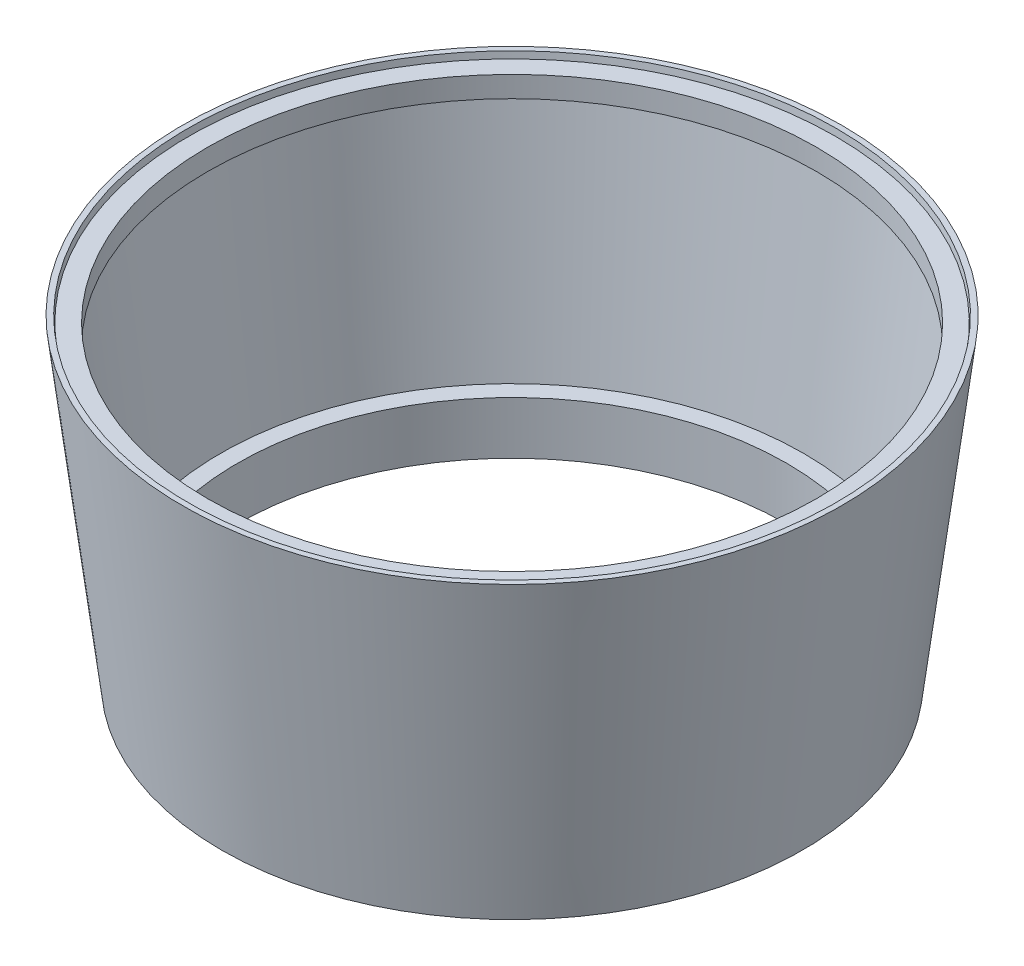
ISO-10303-21;
HEADER;
FILE_DESCRIPTION(('STEP AP214'),'2;1');
FILE_NAME('part.step','',(''),(''),'','','');
FILE_SCHEMA(('AUTOMOTIVE_DESIGN { 1 0 10303 214 1 1 1 1 }'));
ENDSEC;
DATA;
#1=APPLICATION_CONTEXT('core data for automotive mechanical design processes');
#2=APPLICATION_PROTOCOL_DEFINITION('international standard','automotive_design',2000,#1);
#3=PRODUCT_CONTEXT('',#1,'mechanical');
#4=PRODUCT('Part','Part','',(#3));
#5=PRODUCT_RELATED_PRODUCT_CATEGORY('part','',(#4));
#6=PRODUCT_DEFINITION_FORMATION('','',#4);
#7=PRODUCT_DEFINITION_CONTEXT('part definition',#1,'design');
#8=PRODUCT_DEFINITION('design','',#6,#7);
#9=PRODUCT_DEFINITION_SHAPE('','',#8);
#10=(LENGTH_UNIT() NAMED_UNIT(*) SI_UNIT(.MILLI.,.METRE.));
#11=(NAMED_UNIT(*) PLANE_ANGLE_UNIT() SI_UNIT($,.RADIAN.));
#12=(NAMED_UNIT(*) SI_UNIT($,.STERADIAN.) SOLID_ANGLE_UNIT());
#13=UNCERTAINTY_MEASURE_WITH_UNIT(LENGTH_MEASURE(1.E-05),#10,'distance_accuracy_value','');
#14=(GEOMETRIC_REPRESENTATION_CONTEXT(3) GLOBAL_UNCERTAINTY_ASSIGNED_CONTEXT((#13)) GLOBAL_UNIT_ASSIGNED_CONTEXT((#10,
#11,#12)) REPRESENTATION_CONTEXT('',''));
#15=CARTESIAN_POINT('',(0.,0.,0.));
#16=DIRECTION('',(0.,0.,1.));
#17=DIRECTION('',(1.,0.,0.));
#18=AXIS2_PLACEMENT_3D('',#15,#16,#17);
#19=CARTESIAN_POINT('',(-752.,4.52446175005497,0.));
#20=DIRECTION('',(0.,-1.,0.));
#21=DIRECTION('',(0.,0.,-1.));
#22=AXIS2_PLACEMENT_3D('',#19,#20,#21);
#23=CYLINDRICAL_SURFACE('',#22,758.378607461102);
#24=CARTESIAN_POINT('',(-752.,4.52446175005505,0.));
#25=DIRECTION('',(0.,-1.,0.));
#26=DIRECTION('',(0.,0.,-1.));
#27=AXIS2_PLACEMENT_3D('',#24,#25,#26);
#28=CIRCLE('',#27,758.378607461102);
#29=CARTESIAN_POINT('',(-752.,4.52446175005505,-758.378607461102));
#30=VERTEX_POINT('',#29);
#31=EDGE_CURVE('E67',#30,#30,#28,.T.);
#32=ORIENTED_EDGE('',*,*,#31,.T.);
#33=EDGE_LOOP('',(#32));
#34=FACE_BOUND('',#33,.T.);
#35=CARTESIAN_POINT('',(-752.,149.761263661677,0.));
#36=DIRECTION('',(0.,-1.,0.));
#37=DIRECTION('',(0.,0.,-1.));
#38=AXIS2_PLACEMENT_3D('',#35,#36,#37);
#39=CIRCLE('',#38,758.378607461102);
#40=CARTESIAN_POINT('',(-752.,149.761263661677,-758.378607461102));
#41=VERTEX_POINT('',#40);
#42=EDGE_CURVE('E10',#41,#41,#39,.T.);
#43=ORIENTED_EDGE('',*,*,#42,.F.);
#44=EDGE_LOOP('',(#43));
#45=FACE_BOUND('',#44,.T.);
#46=ADVANCED_FACE('F33',(#34,#45),#23,.F.);
#47=CARTESIAN_POINT('',(6.37860746110164,149.761263661677,0.));
#48=DIRECTION('',(0.,1.,0.));
#49=DIRECTION('',(0.,0.,1.));
#50=AXIS2_PLACEMENT_3D('',#47,#48,#49);
#51=PLANE('',#50);
#52=ORIENTED_EDGE('',*,*,#42,.T.);
#53=EDGE_LOOP('',(#52));
#54=FACE_BOUND('',#53,.T.);
#55=CARTESIAN_POINT('',(-752.,149.761263661677,0.));
#56=DIRECTION('',(0.,-1.,0.));
#57=DIRECTION('',(0.,0.,-1.));
#58=AXIS2_PLACEMENT_3D('',#55,#56,#57);
#59=CIRCLE('',#58,805.388370998963);
#60=CARTESIAN_POINT('',(-752.,149.761263661677,-805.388370998963));
#61=VERTEX_POINT('',#60);
#62=EDGE_CURVE('E39',#61,#61,#59,.T.);
#63=ORIENTED_EDGE('',*,*,#62,.F.);
#64=EDGE_LOOP('',(#63));
#65=FACE_BOUND('',#64,.T.);
#66=ADVANCED_FACE('F85',(#54,#65),#51,.T.);
#67=CARTESIAN_POINT('',(-752.,806.23980453219,0.));
#68=DIRECTION('',(0.,1.,0.));
#69=DIRECTION('',(0.,0.,1.));
#70=AXIS2_PLACEMENT_3D('',#67,#68,#69);
#71=CONICAL_SURFACE('',#70,885.993800381926,0.1221730476396);
#72=ORIENTED_EDGE('',*,*,#62,.T.);
#73=EDGE_LOOP('',(#72));
#74=FACE_BOUND('',#73,.T.);
#75=CARTESIAN_POINT('',(-752.,806.23980453219,0.));
#76=DIRECTION('',(0.,-1.,0.));
#77=DIRECTION('',(0.,0.,-1.));
#78=AXIS2_PLACEMENT_3D('',#75,#76,#77);
#79=CIRCLE('',#78,885.993800381926);
#80=CARTESIAN_POINT('',(-752.,806.23980453219,-885.993800381926));
#81=VERTEX_POINT('',#80);
#82=EDGE_CURVE('E43',#81,#81,#79,.T.);
#83=ORIENTED_EDGE('',*,*,#82,.F.);
#84=EDGE_LOOP('',(#83));
#85=FACE_BOUND('',#84,.T.);
#86=ADVANCED_FACE('F89',(#74,#85),#71,.F.);
#87=CARTESIAN_POINT('',(88.9551185315156,806.23980453219,0.));
#88=DIRECTION('',(0.,-1.,0.));
#89=DIRECTION('',(0.,0.,-1.));
#90=AXIS2_PLACEMENT_3D('',#87,#88,#89);
#91=PLANE('',#90);
#92=ORIENTED_EDGE('',*,*,#82,.T.);
#93=EDGE_LOOP('',(#92));
#94=FACE_BOUND('',#93,.T.);
#95=CARTESIAN_POINT('',(-752.,806.23980453219,0.));
#96=DIRECTION('',(0.,-1.,0.));
#97=DIRECTION('',(0.,0.,-1.));
#98=AXIS2_PLACEMENT_3D('',#95,#96,#97);
#99=CIRCLE('',#98,840.955118531516);
#100=CARTESIAN_POINT('',(-752.,806.23980453219,-840.955118531516));
#101=VERTEX_POINT('',#100);
#102=EDGE_CURVE('E47',#101,#101,#99,.T.);
#103=ORIENTED_EDGE('',*,*,#102,.F.);
#104=EDGE_LOOP('',(#103));
#105=FACE_BOUND('',#104,.T.);
#106=ADVANCED_FACE('F93',(#94,#105),#91,.T.);
#107=CARTESIAN_POINT('',(-752.,4.52446175005497,0.));
#108=DIRECTION('',(0.,-1.,0.));
#109=DIRECTION('',(0.,0.,-1.));
#110=AXIS2_PLACEMENT_3D('',#107,#108,#109);
#111=CYLINDRICAL_SURFACE('',#110,840.955118531516);
#112=ORIENTED_EDGE('',*,*,#102,.T.);
#113=EDGE_LOOP('',(#112));
#114=FACE_BOUND('',#113,.T.);
#115=CARTESIAN_POINT('',(-752.,864.413184913381,0.));
#116=DIRECTION('',(0.,-1.,0.));
#117=DIRECTION('',(0.,0.,-1.));
#118=AXIS2_PLACEMENT_3D('',#115,#116,#117);
#119=CIRCLE('',#118,840.955118531516);
#120=CARTESIAN_POINT('',(-752.,864.413184913381,-840.955118531516));
#121=VERTEX_POINT('',#120);
#122=EDGE_CURVE('E52',#121,#121,#119,.T.);
#123=ORIENTED_EDGE('',*,*,#122,.F.);
#124=EDGE_LOOP('',(#123));
#125=FACE_BOUND('',#124,.T.);
#126=ADVANCED_FACE('F99',(#114,#125),#111,.F.);
#127=CARTESIAN_POINT('',(141.136593348268,864.413184913381,0.));
#128=DIRECTION('',(0.,1.,0.));
#129=DIRECTION('',(0.,0.,1.));
#130=AXIS2_PLACEMENT_3D('',#127,#128,#129);
#131=PLANE('',#130);
#132=ORIENTED_EDGE('',*,*,#122,.T.);
#133=EDGE_LOOP('',(#132));
#134=FACE_BOUND('',#133,.T.);
#135=CARTESIAN_POINT('',(-752.,864.413184913381,0.));
#136=DIRECTION('',(0.,-1.,0.));
#137=DIRECTION('',(0.,0.,-1.));
#138=AXIS2_PLACEMENT_3D('',#135,#136,#137);
#139=CIRCLE('',#138,893.136593348268);
#140=CARTESIAN_POINT('',(-752.,864.413184913381,-893.136593348268));
#141=VERTEX_POINT('',#140);
#142=EDGE_CURVE('E55',#141,#141,#139,.T.);
#143=ORIENTED_EDGE('',*,*,#142,.F.);
#144=EDGE_LOOP('',(#143));
#145=FACE_BOUND('',#144,.T.);
#146=ADVANCED_FACE('F103',(#134,#145),#131,.T.);
#147=CARTESIAN_POINT('',(-752.,882.393970053357,0.));
#148=DIRECTION('',(0.,1.,0.));
#149=DIRECTION('',(0.,0.,1.));
#150=AXIS2_PLACEMENT_3D('',#147,#148,#149);
#151=CONICAL_SURFACE('',#150,895.344356156369,0.122173047639598);
#152=ORIENTED_EDGE('',*,*,#142,.T.);
#153=EDGE_LOOP('',(#152));
#154=FACE_BOUND('',#153,.T.);
#155=CARTESIAN_POINT('',(-752.,882.393970053357,0.));
#156=DIRECTION('',(0.,-1.,0.));
#157=DIRECTION('',(0.,0.,-1.));
#158=AXIS2_PLACEMENT_3D('',#155,#156,#157);
#159=CIRCLE('',#158,895.344356156369);
#160=CARTESIAN_POINT('',(-752.,882.393970053357,-895.344356156369));
#161=VERTEX_POINT('',#160);
#162=EDGE_CURVE('E58',#161,#161,#159,.T.);
#163=ORIENTED_EDGE('',*,*,#162,.F.);
#164=EDGE_LOOP('',(#163));
#165=FACE_BOUND('',#164,.T.);
#166=ADVANCED_FACE('F107',(#154,#165),#151,.F.);
#167=CARTESIAN_POINT('',(158.344356156369,882.393970053357,0.));
#168=DIRECTION('',(0.,1.,0.));
#169=DIRECTION('',(0.,0.,1.));
#170=AXIS2_PLACEMENT_3D('',#167,#168,#169);
#171=PLANE('',#170);
#172=ORIENTED_EDGE('',*,*,#162,.T.);
#173=EDGE_LOOP('',(#172));
#174=FACE_BOUND('',#173,.T.);
#175=CARTESIAN_POINT('',(-752.,882.393970053357,0.));
#176=DIRECTION('',(0.,-1.,0.));
#177=DIRECTION('',(0.,0.,-1.));
#178=AXIS2_PLACEMENT_3D('',#175,#176,#177);
#179=CIRCLE('',#178,910.344356156369);
#180=CARTESIAN_POINT('',(-752.,882.393970053357,-910.344356156369));
#181=VERTEX_POINT('',#180);
#182=EDGE_CURVE('E61',#181,#181,#179,.T.);
#183=ORIENTED_EDGE('',*,*,#182,.F.);
#184=EDGE_LOOP('',(#183));
#185=FACE_BOUND('',#184,.T.);
#186=ADVANCED_FACE('F81',(#174,#185),#171,.T.);
#187=CARTESIAN_POINT('',(-752.,4.52446175005505,0.));
#188=DIRECTION('',(0.,1.,0.));
#189=DIRECTION('',(0.,0.,1.));
#190=AXIS2_PLACEMENT_3D('',#187,#188,#189);
#191=CONICAL_SURFACE('',#190,802.555534049302,0.1221730476396);
#192=ORIENTED_EDGE('',*,*,#182,.T.);
#193=EDGE_LOOP('',(#192));
#194=FACE_BOUND('',#193,.T.);
#195=CARTESIAN_POINT('',(-752.,4.52446175005505,0.));
#196=DIRECTION('',(0.,-1.,0.));
#197=DIRECTION('',(0.,0.,-1.));
#198=AXIS2_PLACEMENT_3D('',#195,#196,#197);
#199=CIRCLE('',#198,802.555534049302);
#200=CARTESIAN_POINT('',(-752.,4.52446175005505,-802.555534049302));
#201=VERTEX_POINT('',#200);
#202=EDGE_CURVE('E64',#201,#201,#199,.T.);
#203=ORIENTED_EDGE('',*,*,#202,.F.);
#204=EDGE_LOOP('',(#203));
#205=FACE_BOUND('',#204,.T.);
#206=ADVANCED_FACE('F75',(#194,#205),#191,.T.);
#207=CARTESIAN_POINT('',(6.37860746110164,4.52446175005505,0.));
#208=DIRECTION('',(0.,-1.,0.));
#209=DIRECTION('',(0.,0.,-1.));
#210=AXIS2_PLACEMENT_3D('',#207,#208,#209);
#211=PLANE('',#210);
#212=ORIENTED_EDGE('',*,*,#202,.T.);
#213=EDGE_LOOP('',(#212));
#214=FACE_BOUND('',#213,.T.);
#215=ORIENTED_EDGE('',*,*,#31,.F.);
#216=EDGE_LOOP('',(#215));
#217=FACE_BOUND('',#216,.T.);
#218=ADVANCED_FACE('F73',(#214,#217),#211,.T.);
#219=CLOSED_SHELL('',(#46,#66,#86,#106,#126,#146,#166,#186,#206,#218));
#220=MANIFOLD_SOLID_BREP('B2',#219);
#221=ADVANCED_BREP_SHAPE_REPRESENTATION('',(#18,#220),#14);
#222=SHAPE_DEFINITION_REPRESENTATION(#9,#221);
ENDSEC;
END-ISO-10303-21;
